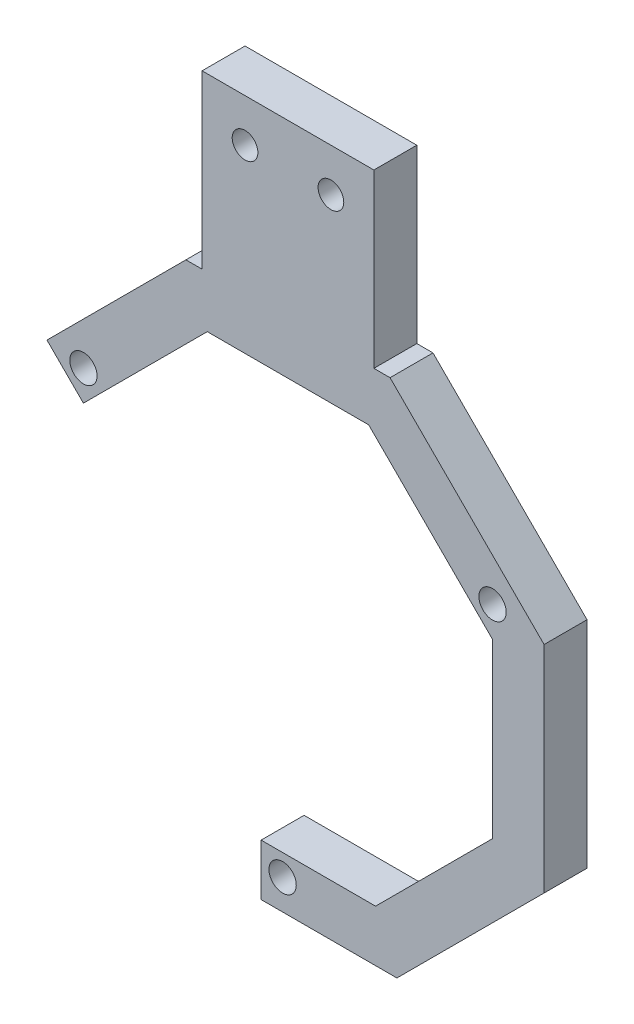
ISO-10303-21;
HEADER;
FILE_DESCRIPTION(('STEP AP214'),'2;1');
FILE_NAME('part.step','',(''),(''),'','','');
FILE_SCHEMA(('AUTOMOTIVE_DESIGN { 1 0 10303 214 1 1 1 1 }'));
ENDSEC;
DATA;
#1=APPLICATION_CONTEXT('core data for automotive mechanical design processes');
#2=APPLICATION_PROTOCOL_DEFINITION('international standard','automotive_design',2000,#1);
#3=PRODUCT_CONTEXT('',#1,'mechanical');
#4=PRODUCT('Part','Part','',(#3));
#5=PRODUCT_RELATED_PRODUCT_CATEGORY('part','',(#4));
#6=PRODUCT_DEFINITION_FORMATION('','',#4);
#7=PRODUCT_DEFINITION_CONTEXT('part definition',#1,'design');
#8=PRODUCT_DEFINITION('design','',#6,#7);
#9=PRODUCT_DEFINITION_SHAPE('','',#8);
#10=(LENGTH_UNIT() NAMED_UNIT(*) SI_UNIT(.MILLI.,.METRE.));
#11=(NAMED_UNIT(*) PLANE_ANGLE_UNIT() SI_UNIT($,.RADIAN.));
#12=(NAMED_UNIT(*) SI_UNIT($,.STERADIAN.) SOLID_ANGLE_UNIT());
#13=UNCERTAINTY_MEASURE_WITH_UNIT(LENGTH_MEASURE(1.E-05),#10,'distance_accuracy_value','');
#14=(GEOMETRIC_REPRESENTATION_CONTEXT(3) GLOBAL_UNCERTAINTY_ASSIGNED_CONTEXT((#13)) GLOBAL_UNIT_ASSIGNED_CONTEXT((#10,
#11,#12)) REPRESENTATION_CONTEXT('',''));
#15=CARTESIAN_POINT('',(0.,0.,0.));
#16=DIRECTION('',(0.,0.,1.));
#17=DIRECTION('',(1.,0.,0.));
#18=AXIS2_PLACEMENT_3D('',#15,#16,#17);
#19=CARTESIAN_POINT('',(-35.6340908998129,17.2379935969734,6.35));
#20=DIRECTION('',(0.707106781186547,0.707106781186548,0.));
#21=DIRECTION('',(-0.707106781186548,0.707106781186547,0.));
#22=AXIS2_PLACEMENT_3D('',#19,#20,#21);
#23=PLANE('',#22);
#24=DIRECTION('',(0.707106781186548,-0.707106781186547,0.));
#25=VECTOR('',#24,1.);
#26=CARTESIAN_POINT('',(-35.6340908998129,17.2379935969734,0.));
#27=LINE('',#26,#25);
#28=CARTESIAN_POINT('',(-35.6340908998129,17.2379935969734,0.));
#29=VERTEX_POINT('',#28);
#30=CARTESIAN_POINT('',(-30.2459372271714,11.8498399243319,0.));
#31=VERTEX_POINT('',#30);
#32=EDGE_CURVE('E188',#29,#31,#27,.T.);
#33=ORIENTED_EDGE('',*,*,#32,.T.);
#34=DIRECTION('',(0.,0.,-1.));
#35=VECTOR('',#34,1.);
#36=CARTESIAN_POINT('',(-30.2459372271714,11.8498399243319,6.35));
#37=LINE('',#36,#35);
#38=CARTESIAN_POINT('',(-30.2459372271714,11.8498399243319,6.35));
#39=VERTEX_POINT('',#38);
#40=EDGE_CURVE('E11',#39,#31,#37,.T.);
#41=ORIENTED_EDGE('',*,*,#40,.F.);
#42=DIRECTION('',(0.707106781186548,-0.707106781186547,0.));
#43=VECTOR('',#42,1.);
#44=CARTESIAN_POINT('',(-35.6340908998129,17.2379935969734,6.35));
#45=LINE('',#44,#43);
#46=CARTESIAN_POINT('',(-35.6340908998129,17.2379935969734,6.35));
#47=VERTEX_POINT('',#46);
#48=EDGE_CURVE('E223',#47,#39,#45,.T.);
#49=ORIENTED_EDGE('',*,*,#48,.F.);
#50=DIRECTION('',(0.,0.,-1.));
#51=VECTOR('',#50,1.);
#52=CARTESIAN_POINT('',(-35.6340908998129,17.2379935969734,6.35));
#53=LINE('',#52,#51);
#54=EDGE_CURVE('E184',#47,#29,#53,.T.);
#55=ORIENTED_EDGE('',*,*,#54,.T.);
#56=EDGE_LOOP('',(#33,#41,#49,#55));
#57=FACE_BOUND('',#56,.T.);
#58=ADVANCED_FACE('F32',(#57),#23,.F.);
#59=CARTESIAN_POINT('',(-30.2459372271714,11.8498399243319,6.35));
#60=DIRECTION('',(-0.707106781186548,0.707106781186547,0.));
#61=DIRECTION('',(-0.707106781186547,-0.707106781186548,0.));
#62=AXIS2_PLACEMENT_3D('',#59,#60,#61);
#63=PLANE('',#62);
#64=DIRECTION('',(0.707106781186547,0.707106781186548,0.));
#65=VECTOR('',#64,1.);
#66=CARTESIAN_POINT('',(-30.2459372271714,11.8498399243319,0.));
#67=LINE('',#66,#65);
#68=CARTESIAN_POINT('',(-11.9332771515032,30.1625000000002,0.));
#69=VERTEX_POINT('',#68);
#70=EDGE_CURVE('E191',#31,#69,#67,.T.);
#71=ORIENTED_EDGE('',*,*,#70,.T.);
#72=DIRECTION('',(0.,0.,-1.));
#73=VECTOR('',#72,1.);
#74=CARTESIAN_POINT('',(-11.9332771515032,30.1625000000002,6.35));
#75=LINE('',#74,#73);
#76=CARTESIAN_POINT('',(-11.9332771515032,30.1625000000002,6.35));
#77=VERTEX_POINT('',#76);
#78=EDGE_CURVE('E40',#77,#69,#75,.T.);
#79=ORIENTED_EDGE('',*,*,#78,.F.);
#80=DIRECTION('',(0.707106781186547,0.707106781186548,0.));
#81=VECTOR('',#80,1.);
#82=CARTESIAN_POINT('',(-30.2459372271714,11.8498399243319,6.35));
#83=LINE('',#82,#81);
#84=EDGE_CURVE('E121',#39,#77,#83,.T.);
#85=ORIENTED_EDGE('',*,*,#84,.F.);
#86=ORIENTED_EDGE('',*,*,#40,.T.);
#87=EDGE_LOOP('',(#71,#79,#85,#86));
#88=FACE_BOUND('',#87,.T.);
#89=ADVANCED_FACE('F332',(#88),#63,.F.);
#90=CARTESIAN_POINT('',(-11.9332771515032,30.1625000000002,6.35));
#91=DIRECTION('',(0.,1.,0.));
#92=DIRECTION('',(0.,0.,1.));
#93=AXIS2_PLACEMENT_3D('',#90,#91,#92);
#94=PLANE('',#93);
#95=DIRECTION('',(1.,0.,0.));
#96=VECTOR('',#95,1.);
#97=CARTESIAN_POINT('',(-11.9332771515032,30.1625000000002,0.));
#98=LINE('',#97,#96);
#99=CARTESIAN_POINT('',(11.9332771515033,30.1625000000002,0.));
#100=VERTEX_POINT('',#99);
#101=EDGE_CURVE('E194',#69,#100,#98,.T.);
#102=ORIENTED_EDGE('',*,*,#101,.T.);
#103=DIRECTION('',(0.,0.,-1.));
#104=VECTOR('',#103,1.);
#105=CARTESIAN_POINT('',(11.9332771515033,30.1625000000002,6.35));
#106=LINE('',#105,#104);
#107=CARTESIAN_POINT('',(11.9332771515033,30.1625000000002,6.35));
#108=VERTEX_POINT('',#107);
#109=EDGE_CURVE('E260',#108,#100,#106,.T.);
#110=ORIENTED_EDGE('',*,*,#109,.F.);
#111=DIRECTION('',(1.,0.,0.));
#112=VECTOR('',#111,1.);
#113=CARTESIAN_POINT('',(-11.9332771515032,30.1625000000002,6.35));
#114=LINE('',#113,#112);
#115=EDGE_CURVE('E268',#77,#108,#114,.T.);
#116=ORIENTED_EDGE('',*,*,#115,.F.);
#117=ORIENTED_EDGE('',*,*,#78,.T.);
#118=EDGE_LOOP('',(#102,#110,#116,#117));
#119=FACE_BOUND('',#118,.T.);
#120=ADVANCED_FACE('F266',(#119),#94,.F.);
#121=CARTESIAN_POINT('',(11.9332771515033,30.1625000000002,6.35));
#122=DIRECTION('',(0.70710678118655,0.707106781186545,0.));
#123=DIRECTION('',(-0.707106781186545,0.70710678118655,0.));
#124=AXIS2_PLACEMENT_3D('',#121,#122,#123);
#125=PLANE('',#124);
#126=DIRECTION('',(0.707106781186545,-0.70710678118655,0.));
#127=VECTOR('',#126,1.);
#128=CARTESIAN_POINT('',(11.9332771515033,30.1625000000002,0.));
#129=LINE('',#128,#127);
#130=CARTESIAN_POINT('',(30.2459372271714,11.8498399243319,0.));
#131=VERTEX_POINT('',#130);
#132=EDGE_CURVE('E196',#100,#131,#129,.T.);
#133=ORIENTED_EDGE('',*,*,#132,.T.);
#134=DIRECTION('',(0.,0.,-1.));
#135=VECTOR('',#134,1.);
#136=CARTESIAN_POINT('',(30.2459372271714,11.8498399243319,6.35));
#137=LINE('',#136,#135);
#138=CARTESIAN_POINT('',(30.2459372271714,11.8498399243319,6.35));
#139=VERTEX_POINT('',#138);
#140=EDGE_CURVE('E257',#139,#131,#137,.T.);
#141=ORIENTED_EDGE('',*,*,#140,.F.);
#142=DIRECTION('',(0.707106781186545,-0.70710678118655,0.));
#143=VECTOR('',#142,1.);
#144=CARTESIAN_POINT('',(11.9332771515033,30.1625000000002,6.35));
#145=LINE('',#144,#143);
#146=EDGE_CURVE('E286',#108,#139,#145,.T.);
#147=ORIENTED_EDGE('',*,*,#146,.F.);
#148=ORIENTED_EDGE('',*,*,#109,.T.);
#149=EDGE_LOOP('',(#133,#141,#147,#148));
#150=FACE_BOUND('',#149,.T.);
#151=ADVANCED_FACE('F277',(#150),#125,.F.);
#152=CARTESIAN_POINT('',(30.2459372271714,11.8498399243319,6.35));
#153=DIRECTION('',(1.,0.,0.));
#154=DIRECTION('',(0.,0.,-1.));
#155=AXIS2_PLACEMENT_3D('',#152,#153,#154);
#156=PLANE('',#155);
#157=DIRECTION('',(0.,-1.,0.));
#158=VECTOR('',#157,1.);
#159=CARTESIAN_POINT('',(30.2459372271714,11.8498399243319,0.));
#160=LINE('',#159,#158);
#161=CARTESIAN_POINT('',(30.2459372271714,-13.6593188938978,0.));
#162=VERTEX_POINT('',#161);
#163=EDGE_CURVE('E198',#131,#162,#160,.T.);
#164=ORIENTED_EDGE('',*,*,#163,.T.);
#165=DIRECTION('',(0.,0.,-1.));
#166=VECTOR('',#165,1.);
#167=CARTESIAN_POINT('',(30.2459372271714,-13.6593188938978,6.35));
#168=LINE('',#167,#166);
#169=CARTESIAN_POINT('',(30.2459372271714,-13.6593188938978,6.35));
#170=VERTEX_POINT('',#169);
#171=EDGE_CURVE('E254',#170,#162,#168,.T.);
#172=ORIENTED_EDGE('',*,*,#171,.F.);
#173=DIRECTION('',(0.,-1.,0.));
#174=VECTOR('',#173,1.);
#175=CARTESIAN_POINT('',(30.2459372271714,11.8498399243319,6.35));
#176=LINE('',#175,#174);
#177=EDGE_CURVE('E283',#139,#170,#176,.T.);
#178=ORIENTED_EDGE('',*,*,#177,.F.);
#179=ORIENTED_EDGE('',*,*,#140,.T.);
#180=EDGE_LOOP('',(#164,#172,#178,#179));
#181=FACE_BOUND('',#180,.T.);
#182=ADVANCED_FACE('F281',(#181),#156,.F.);
#183=CARTESIAN_POINT('',(30.2459372271714,-13.6593188938978,6.35));
#184=DIRECTION('',(0.707106781186546,-0.707106781186549,0.));
#185=DIRECTION('',(0.707106781186549,0.707106781186546,0.));
#186=AXIS2_PLACEMENT_3D('',#183,#184,#185);
#187=PLANE('',#186);
#188=DIRECTION('',(-0.707106781186549,-0.707106781186546,0.));
#189=VECTOR('',#188,1.);
#190=CARTESIAN_POINT('',(30.2459372271714,-13.6593188938978,0.));
#191=LINE('',#190,#189);
#192=CARTESIAN_POINT('',(12.9490061210692,-30.95625,0.));
#193=VERTEX_POINT('',#192);
#194=EDGE_CURVE('E200',#162,#193,#191,.T.);
#195=ORIENTED_EDGE('',*,*,#194,.T.);
#196=DIRECTION('',(0.,0.,-1.));
#197=VECTOR('',#196,1.);
#198=CARTESIAN_POINT('',(12.9490061210692,-30.95625,6.35));
#199=LINE('',#198,#197);
#200=CARTESIAN_POINT('',(12.9490061210692,-30.95625,6.35));
#201=VERTEX_POINT('',#200);
#202=EDGE_CURVE('E251',#201,#193,#199,.T.);
#203=ORIENTED_EDGE('',*,*,#202,.F.);
#204=DIRECTION('',(-0.707106781186549,-0.707106781186546,0.));
#205=VECTOR('',#204,1.);
#206=CARTESIAN_POINT('',(30.2459372271714,-13.6593188938978,6.35));
#207=LINE('',#206,#205);
#208=EDGE_CURVE('E285',#170,#201,#207,.T.);
#209=ORIENTED_EDGE('',*,*,#208,.F.);
#210=ORIENTED_EDGE('',*,*,#171,.T.);
#211=EDGE_LOOP('',(#195,#203,#209,#210));
#212=FACE_BOUND('',#211,.T.);
#213=ADVANCED_FACE('F345',(#212),#187,.F.);
#214=CARTESIAN_POINT('',(12.9490061210692,-30.95625,6.35));
#215=DIRECTION('',(0.,-1.,0.));
#216=DIRECTION('',(1.,0.,0.));
#217=AXIS2_PLACEMENT_3D('',#214,#215,#216);
#218=PLANE('',#217);
#219=DIRECTION('',(-1.,0.,0.));
#220=VECTOR('',#219,1.);
#221=CARTESIAN_POINT('',(12.9490061210692,-30.95625,0.));
#222=LINE('',#221,#220);
#223=CARTESIAN_POINT('',(-3.96875,-30.95625,0.));
#224=VERTEX_POINT('',#223);
#225=EDGE_CURVE('E202',#193,#224,#222,.T.);
#226=ORIENTED_EDGE('',*,*,#225,.T.);
#227=DIRECTION('',(0.,0.,-1.));
#228=VECTOR('',#227,1.);
#229=CARTESIAN_POINT('',(-3.96875,-30.95625,6.35));
#230=LINE('',#229,#228);
#231=CARTESIAN_POINT('',(-3.96875,-30.95625,6.35));
#232=VERTEX_POINT('',#231);
#233=EDGE_CURVE('E248',#232,#224,#230,.T.);
#234=ORIENTED_EDGE('',*,*,#233,.F.);
#235=DIRECTION('',(-1.,0.,0.));
#236=VECTOR('',#235,1.);
#237=CARTESIAN_POINT('',(12.9490061210692,-30.95625,6.35));
#238=LINE('',#237,#236);
#239=EDGE_CURVE('E288',#201,#232,#238,.T.);
#240=ORIENTED_EDGE('',*,*,#239,.F.);
#241=ORIENTED_EDGE('',*,*,#202,.T.);
#242=EDGE_LOOP('',(#226,#234,#240,#241));
#243=FACE_BOUND('',#242,.T.);
#244=ADVANCED_FACE('F348',(#243),#218,.F.);
#245=CARTESIAN_POINT('',(-3.96875,-30.95625,6.35));
#246=DIRECTION('',(1.,0.,0.));
#247=DIRECTION('',(0.,1.,0.));
#248=AXIS2_PLACEMENT_3D('',#245,#246,#247);
#249=PLANE('',#248);
#250=DIRECTION('',(0.,-1.,0.));
#251=VECTOR('',#250,1.);
#252=CARTESIAN_POINT('',(-3.96875,-30.95625,0.));
#253=LINE('',#252,#251);
#254=CARTESIAN_POINT('',(-3.96875,-38.57625,0.));
#255=VERTEX_POINT('',#254);
#256=EDGE_CURVE('E204',#224,#255,#253,.T.);
#257=ORIENTED_EDGE('',*,*,#256,.T.);
#258=DIRECTION('',(0.,0.,-1.));
#259=VECTOR('',#258,1.);
#260=CARTESIAN_POINT('',(-3.96875,-38.57625,6.35));
#261=LINE('',#260,#259);
#262=CARTESIAN_POINT('',(-3.96875,-38.57625,6.35));
#263=VERTEX_POINT('',#262);
#264=EDGE_CURVE('E245',#263,#255,#261,.T.);
#265=ORIENTED_EDGE('',*,*,#264,.F.);
#266=DIRECTION('',(0.,-1.,0.));
#267=VECTOR('',#266,1.);
#268=CARTESIAN_POINT('',(-3.96875,-30.95625,6.35));
#269=LINE('',#268,#267);
#270=EDGE_CURVE('E294',#232,#263,#269,.T.);
#271=ORIENTED_EDGE('',*,*,#270,.F.);
#272=ORIENTED_EDGE('',*,*,#233,.T.);
#273=EDGE_LOOP('',(#257,#265,#271,#272));
#274=FACE_BOUND('',#273,.T.);
#275=ADVANCED_FACE('F352',(#274),#249,.F.);
#276=CARTESIAN_POINT('',(-3.96875,-38.57625,6.35));
#277=DIRECTION('',(0.,1.,0.));
#278=DIRECTION('',(0.,0.,1.));
#279=AXIS2_PLACEMENT_3D('',#276,#277,#278);
#280=PLANE('',#279);
#281=DIRECTION('',(1.,0.,0.));
#282=VECTOR('',#281,1.);
#283=CARTESIAN_POINT('',(-3.96875,-38.57625,0.));
#284=LINE('',#283,#282);
#285=CARTESIAN_POINT('',(16.1053134663522,-38.57625,0.));
#286=VERTEX_POINT('',#285);
#287=EDGE_CURVE('E206',#255,#286,#284,.T.);
#288=ORIENTED_EDGE('',*,*,#287,.T.);
#289=DIRECTION('',(0.,0.,-1.));
#290=VECTOR('',#289,1.);
#291=CARTESIAN_POINT('',(16.1053134663522,-38.57625,6.35));
#292=LINE('',#291,#290);
#293=CARTESIAN_POINT('',(16.1053134663522,-38.57625,6.35));
#294=VERTEX_POINT('',#293);
#295=EDGE_CURVE('E242',#294,#286,#292,.T.);
#296=ORIENTED_EDGE('',*,*,#295,.F.);
#297=DIRECTION('',(1.,0.,0.));
#298=VECTOR('',#297,1.);
#299=CARTESIAN_POINT('',(-3.96875,-38.57625,6.35));
#300=LINE('',#299,#298);
#301=EDGE_CURVE('E296',#263,#294,#300,.T.);
#302=ORIENTED_EDGE('',*,*,#301,.F.);
#303=ORIENTED_EDGE('',*,*,#264,.T.);
#304=EDGE_LOOP('',(#288,#296,#302,#303));
#305=FACE_BOUND('',#304,.T.);
#306=ADVANCED_FACE('F356',(#305),#280,.F.);
#307=CARTESIAN_POINT('',(37.8659372271714,-16.8156262391808,6.35));
#308=DIRECTION('',(-0.707106781186546,0.707106781186549,0.));
#309=DIRECTION('',(-0.707106781186549,-0.707106781186546,0.));
#310=AXIS2_PLACEMENT_3D('',#307,#308,#309);
#311=PLANE('',#310);
#312=DIRECTION('',(0.707106781186549,0.707106781186546,0.));
#313=VECTOR('',#312,1.);
#314=CARTESIAN_POINT('',(37.8659372271714,-16.8156262391808,0.));
#315=LINE('',#314,#313);
#316=CARTESIAN_POINT('',(37.8659372271714,-16.8156262391808,0.));
#317=VERTEX_POINT('',#316);
#318=EDGE_CURVE('E208',#286,#317,#315,.T.);
#319=ORIENTED_EDGE('',*,*,#318,.T.);
#320=DIRECTION('',(0.,0.,-1.));
#321=VECTOR('',#320,1.);
#322=CARTESIAN_POINT('',(37.8659372271714,-16.8156262391808,6.35));
#323=LINE('',#322,#321);
#324=CARTESIAN_POINT('',(37.8659372271714,-16.8156262391808,6.35));
#325=VERTEX_POINT('',#324);
#326=EDGE_CURVE('E239',#325,#317,#323,.T.);
#327=ORIENTED_EDGE('',*,*,#326,.F.);
#328=DIRECTION('',(0.707106781186549,0.707106781186546,0.));
#329=VECTOR('',#328,1.);
#330=CARTESIAN_POINT('',(37.8659372271714,-16.8156262391808,6.35));
#331=LINE('',#330,#329);
#332=EDGE_CURVE('E298',#294,#325,#331,.T.);
#333=ORIENTED_EDGE('',*,*,#332,.F.);
#334=ORIENTED_EDGE('',*,*,#295,.T.);
#335=EDGE_LOOP('',(#319,#327,#333,#334));
#336=FACE_BOUND('',#335,.T.);
#337=ADVANCED_FACE('F360',(#336),#311,.F.);
#338=CARTESIAN_POINT('',(37.8659372271714,15.0061472696149,6.35));
#339=DIRECTION('',(-1.,0.,0.));
#340=DIRECTION('',(0.,-1.,0.));
#341=AXIS2_PLACEMENT_3D('',#338,#339,#340);
#342=PLANE('',#341);
#343=DIRECTION('',(0.,1.,0.));
#344=VECTOR('',#343,1.);
#345=CARTESIAN_POINT('',(37.8659372271714,15.0061472696149,0.));
#346=LINE('',#345,#344);
#347=CARTESIAN_POINT('',(37.8659372271714,15.0061472696149,0.));
#348=VERTEX_POINT('',#347);
#349=EDGE_CURVE('E210',#317,#348,#346,.T.);
#350=ORIENTED_EDGE('',*,*,#349,.T.);
#351=DIRECTION('',(0.,0.,-1.));
#352=VECTOR('',#351,1.);
#353=CARTESIAN_POINT('',(37.8659372271714,15.0061472696149,6.35));
#354=LINE('',#353,#352);
#355=CARTESIAN_POINT('',(37.8659372271714,15.0061472696149,6.35));
#356=VERTEX_POINT('',#355);
#357=EDGE_CURVE('E236',#356,#348,#354,.T.);
#358=ORIENTED_EDGE('',*,*,#357,.F.);
#359=DIRECTION('',(0.,1.,0.));
#360=VECTOR('',#359,1.);
#361=CARTESIAN_POINT('',(37.8659372271714,15.0061472696149,6.35));
#362=LINE('',#361,#360);
#363=EDGE_CURVE('E300',#325,#356,#362,.T.);
#364=ORIENTED_EDGE('',*,*,#363,.F.);
#365=ORIENTED_EDGE('',*,*,#326,.T.);
#366=EDGE_LOOP('',(#350,#358,#364,#365));
#367=FACE_BOUND('',#366,.T.);
#368=ADVANCED_FACE('F364',(#367),#342,.F.);
#369=CARTESIAN_POINT('',(15.0895844967863,37.7825000000002,6.35));
#370=DIRECTION('',(-0.70710678118655,-0.707106781186545,0.));
#371=DIRECTION('',(0.707106781186545,-0.70710678118655,0.));
#372=AXIS2_PLACEMENT_3D('',#369,#370,#371);
#373=PLANE('',#372);
#374=DIRECTION('',(-0.707106781186545,0.70710678118655,0.));
#375=VECTOR('',#374,1.);
#376=CARTESIAN_POINT('',(15.0895844967863,37.7825000000002,0.));
#377=LINE('',#376,#375);
#378=CARTESIAN_POINT('',(15.0895844967863,37.7825000000002,0.));
#379=VERTEX_POINT('',#378);
#380=EDGE_CURVE('E212',#348,#379,#377,.T.);
#381=ORIENTED_EDGE('',*,*,#380,.T.);
#382=DIRECTION('',(0.,0.,-1.));
#383=VECTOR('',#382,1.);
#384=CARTESIAN_POINT('',(15.0895844967863,37.7825000000002,6.35));
#385=LINE('',#384,#383);
#386=CARTESIAN_POINT('',(15.0895844967863,37.7825000000002,6.35));
#387=VERTEX_POINT('',#386);
#388=EDGE_CURVE('E233',#387,#379,#385,.T.);
#389=ORIENTED_EDGE('',*,*,#388,.F.);
#390=DIRECTION('',(-0.707106781186545,0.70710678118655,0.));
#391=VECTOR('',#390,1.);
#392=CARTESIAN_POINT('',(15.0895844967863,37.7825000000002,6.35));
#393=LINE('',#392,#391);
#394=EDGE_CURVE('E302',#356,#387,#393,.T.);
#395=ORIENTED_EDGE('',*,*,#394,.F.);
#396=ORIENTED_EDGE('',*,*,#357,.T.);
#397=EDGE_LOOP('',(#381,#389,#395,#396));
#398=FACE_BOUND('',#397,.T.);
#399=ADVANCED_FACE('F368',(#398),#373,.F.);
#400=CARTESIAN_POINT('',(12.7,37.7825000000002,6.35));
#401=DIRECTION('',(0.,-1.,0.));
#402=DIRECTION('',(0.,0.,-1.));
#403=AXIS2_PLACEMENT_3D('',#400,#401,#402);
#404=PLANE('',#403);
#405=DIRECTION('',(-1.,0.,0.));
#406=VECTOR('',#405,1.);
#407=CARTESIAN_POINT('',(12.7,37.7825000000002,0.));
#408=LINE('',#407,#406);
#409=CARTESIAN_POINT('',(12.7,37.7825000000002,0.));
#410=VERTEX_POINT('',#409);
#411=EDGE_CURVE('E214',#379,#410,#408,.T.);
#412=ORIENTED_EDGE('',*,*,#411,.T.);
#413=DIRECTION('',(0.,0.,-1.));
#414=VECTOR('',#413,1.);
#415=CARTESIAN_POINT('',(12.7,37.7825000000002,6.35));
#416=LINE('',#415,#414);
#417=CARTESIAN_POINT('',(12.7,37.7825000000002,6.35));
#418=VERTEX_POINT('',#417);
#419=EDGE_CURVE('E230',#418,#410,#416,.T.);
#420=ORIENTED_EDGE('',*,*,#419,.F.);
#421=DIRECTION('',(-1.,0.,0.));
#422=VECTOR('',#421,1.);
#423=CARTESIAN_POINT('',(12.7,37.7825000000002,6.35));
#424=LINE('',#423,#422);
#425=EDGE_CURVE('E304',#387,#418,#424,.T.);
#426=ORIENTED_EDGE('',*,*,#425,.F.);
#427=ORIENTED_EDGE('',*,*,#388,.T.);
#428=EDGE_LOOP('',(#412,#420,#426,#427));
#429=FACE_BOUND('',#428,.T.);
#430=ADVANCED_FACE('F372',(#429),#404,.F.);
#431=CARTESIAN_POINT('',(12.7,37.7825000000002,6.35));
#432=DIRECTION('',(-1.,0.,0.));
#433=DIRECTION('',(0.,-1.,0.));
#434=AXIS2_PLACEMENT_3D('',#431,#432,#433);
#435=PLANE('',#434);
#436=DIRECTION('',(0.,1.,0.));
#437=VECTOR('',#436,1.);
#438=CARTESIAN_POINT('',(12.7,37.7825000000002,0.));
#439=LINE('',#438,#437);
#440=CARTESIAN_POINT('',(12.7,63.1825000000002,0.));
#441=VERTEX_POINT('',#440);
#442=EDGE_CURVE('E216',#410,#441,#439,.T.);
#443=ORIENTED_EDGE('',*,*,#442,.T.);
#444=DIRECTION('',(0.,0.,-1.));
#445=VECTOR('',#444,1.);
#446=CARTESIAN_POINT('',(12.7,63.1825000000002,6.35));
#447=LINE('',#446,#445);
#448=CARTESIAN_POINT('',(12.7,63.1825000000002,6.35));
#449=VERTEX_POINT('',#448);
#450=EDGE_CURVE('E227',#449,#441,#447,.T.);
#451=ORIENTED_EDGE('',*,*,#450,.F.);
#452=DIRECTION('',(0.,1.,0.));
#453=VECTOR('',#452,1.);
#454=CARTESIAN_POINT('',(12.7,37.7825000000002,6.35));
#455=LINE('',#454,#453);
#456=EDGE_CURVE('E306',#418,#449,#455,.T.);
#457=ORIENTED_EDGE('',*,*,#456,.F.);
#458=ORIENTED_EDGE('',*,*,#419,.T.);
#459=EDGE_LOOP('',(#443,#451,#457,#458));
#460=FACE_BOUND('',#459,.T.);
#461=ADVANCED_FACE('F312',(#460),#435,.F.);
#462=CARTESIAN_POINT('',(-12.7,63.1825000000002,6.35));
#463=DIRECTION('',(0.,-1.,0.));
#464=DIRECTION('',(0.,0.,-1.));
#465=AXIS2_PLACEMENT_3D('',#462,#463,#464);
#466=PLANE('',#465);
#467=DIRECTION('',(-1.,0.,0.));
#468=VECTOR('',#467,1.);
#469=CARTESIAN_POINT('',(-12.7,63.1825000000002,0.));
#470=LINE('',#469,#468);
#471=CARTESIAN_POINT('',(-12.7,63.1825000000002,0.));
#472=VERTEX_POINT('',#471);
#473=EDGE_CURVE('E218',#441,#472,#470,.T.);
#474=ORIENTED_EDGE('',*,*,#473,.T.);
#475=DIRECTION('',(0.,0.,-1.));
#476=VECTOR('',#475,1.);
#477=CARTESIAN_POINT('',(-12.7,63.1825000000002,6.35));
#478=LINE('',#477,#476);
#479=CARTESIAN_POINT('',(-12.7,63.1825000000002,6.35));
#480=VERTEX_POINT('',#479);
#481=EDGE_CURVE('E179',#480,#472,#478,.T.);
#482=ORIENTED_EDGE('',*,*,#481,.F.);
#483=DIRECTION('',(-1.,0.,0.));
#484=VECTOR('',#483,1.);
#485=CARTESIAN_POINT('',(-12.7,63.1825000000002,6.35));
#486=LINE('',#485,#484);
#487=EDGE_CURVE('E170',#449,#480,#486,.T.);
#488=ORIENTED_EDGE('',*,*,#487,.F.);
#489=ORIENTED_EDGE('',*,*,#450,.T.);
#490=EDGE_LOOP('',(#474,#482,#488,#489));
#491=FACE_BOUND('',#490,.T.);
#492=ADVANCED_FACE('F316',(#491),#466,.F.);
#493=CARTESIAN_POINT('',(-12.7,37.7825000000002,6.35));
#494=DIRECTION('',(1.,0.,0.));
#495=DIRECTION('',(0.,1.,0.));
#496=AXIS2_PLACEMENT_3D('',#493,#494,#495);
#497=PLANE('',#496);
#498=DIRECTION('',(0.,-1.,0.));
#499=VECTOR('',#498,1.);
#500=CARTESIAN_POINT('',(-12.7,37.7825000000002,0.));
#501=LINE('',#500,#499);
#502=CARTESIAN_POINT('',(-12.7,37.7825000000002,0.));
#503=VERTEX_POINT('',#502);
#504=EDGE_CURVE('E178',#472,#503,#501,.T.);
#505=ORIENTED_EDGE('',*,*,#504,.T.);
#506=DIRECTION('',(0.,0.,-1.));
#507=VECTOR('',#506,1.);
#508=CARTESIAN_POINT('',(-12.7,37.7825000000002,6.35));
#509=LINE('',#508,#507);
#510=CARTESIAN_POINT('',(-12.7,37.7825000000002,6.35));
#511=VERTEX_POINT('',#510);
#512=EDGE_CURVE('E175',#511,#503,#509,.T.);
#513=ORIENTED_EDGE('',*,*,#512,.F.);
#514=DIRECTION('',(0.,-1.,0.));
#515=VECTOR('',#514,1.);
#516=CARTESIAN_POINT('',(-12.7,37.7825000000002,6.35));
#517=LINE('',#516,#515);
#518=EDGE_CURVE('E164',#480,#511,#517,.T.);
#519=ORIENTED_EDGE('',*,*,#518,.F.);
#520=ORIENTED_EDGE('',*,*,#481,.T.);
#521=EDGE_LOOP('',(#505,#513,#519,#520));
#522=FACE_BOUND('',#521,.T.);
#523=ADVANCED_FACE('F176',(#522),#497,.F.);
#524=CARTESIAN_POINT('',(-15.0895844967862,37.7825000000002,6.35));
#525=DIRECTION('',(0.,-1.,0.));
#526=DIRECTION('',(0.,0.,-1.));
#527=AXIS2_PLACEMENT_3D('',#524,#525,#526);
#528=PLANE('',#527);
#529=DIRECTION('',(-1.,0.,0.));
#530=VECTOR('',#529,1.);
#531=CARTESIAN_POINT('',(-15.0895844967862,37.7825000000002,0.));
#532=LINE('',#531,#530);
#533=CARTESIAN_POINT('',(-15.0895844967862,37.7825000000002,0.));
#534=VERTEX_POINT('',#533);
#535=EDGE_CURVE('E107',#503,#534,#532,.T.);
#536=ORIENTED_EDGE('',*,*,#535,.T.);
#537=DIRECTION('',(0.,0.,-1.));
#538=VECTOR('',#537,1.);
#539=CARTESIAN_POINT('',(-15.0895844967862,37.7825000000002,6.35));
#540=LINE('',#539,#538);
#541=CARTESIAN_POINT('',(-15.0895844967862,37.7825000000002,6.35));
#542=VERTEX_POINT('',#541);
#543=EDGE_CURVE('E180',#542,#534,#540,.T.);
#544=ORIENTED_EDGE('',*,*,#543,.F.);
#545=DIRECTION('',(-1.,0.,0.));
#546=VECTOR('',#545,1.);
#547=CARTESIAN_POINT('',(-15.0895844967862,37.7825000000002,6.35));
#548=LINE('',#547,#546);
#549=EDGE_CURVE('E168',#511,#542,#548,.T.);
#550=ORIENTED_EDGE('',*,*,#549,.F.);
#551=ORIENTED_EDGE('',*,*,#512,.T.);
#552=EDGE_LOOP('',(#536,#544,#550,#551));
#553=FACE_BOUND('',#552,.T.);
#554=ADVANCED_FACE('F182',(#553),#528,.F.);
#555=CARTESIAN_POINT('',(-35.6340908998129,17.2379935969734,6.35));
#556=DIRECTION('',(0.707106781186548,-0.707106781186547,0.));
#557=DIRECTION('',(0.707106781186547,0.707106781186548,0.));
#558=AXIS2_PLACEMENT_3D('',#555,#556,#557);
#559=PLANE('',#558);
#560=DIRECTION('',(-0.707106781186547,-0.707106781186548,0.));
#561=VECTOR('',#560,1.);
#562=CARTESIAN_POINT('',(-35.6340908998129,17.2379935969734,0.));
#563=LINE('',#562,#561);
#564=EDGE_CURVE('E113',#534,#29,#563,.T.);
#565=ORIENTED_EDGE('',*,*,#564,.T.);
#566=ORIENTED_EDGE('',*,*,#54,.F.);
#567=DIRECTION('',(-0.707106781186547,-0.707106781186548,0.));
#568=VECTOR('',#567,1.);
#569=CARTESIAN_POINT('',(-35.6340908998129,17.2379935969734,6.35));
#570=LINE('',#569,#568);
#571=EDGE_CURVE('E48',#542,#47,#570,.T.);
#572=ORIENTED_EDGE('',*,*,#571,.F.);
#573=ORIENTED_EDGE('',*,*,#543,.T.);
#574=EDGE_LOOP('',(#565,#566,#572,#573));
#575=FACE_BOUND('',#574,.T.);
#576=ADVANCED_FACE('F320',(#575),#559,.F.);
#577=CARTESIAN_POINT('',(0.,0.,6.35));
#578=DIRECTION('',(0.,0.,1.));
#579=DIRECTION('',(1.,0.,0.));
#580=AXIS2_PLACEMENT_3D('',#577,#578,#579);
#581=PLANE('',#580);
#582=CARTESIAN_POINT('',(-6.34999999999996,56.8325000000002,6.35));
#583=DIRECTION('',(0.,0.,1.));
#584=DIRECTION('',(1.,0.,0.));
#585=AXIS2_PLACEMENT_3D('',#582,#583,#584);
#586=CIRCLE('',#585,1.89864999999999);
#587=CARTESIAN_POINT('',(-4.45134999999998,56.8325000000002,6.35));
#588=VERTEX_POINT('',#587);
#589=EDGE_CURVE('E468',#588,#588,#586,.T.);
#590=ORIENTED_EDGE('',*,*,#589,.F.);
#591=EDGE_LOOP('',(#590));
#592=FACE_BOUND('',#591,.T.);
#593=CARTESIAN_POINT('',(6.35000000000004,56.8325000000002,6.35));
#594=DIRECTION('',(0.,0.,1.));
#595=DIRECTION('',(1.,0.,0.));
#596=AXIS2_PLACEMENT_3D('',#593,#594,#595);
#597=CIRCLE('',#596,1.89864999999999);
#598=CARTESIAN_POINT('',(8.24865000000002,56.8325000000002,6.35));
#599=VERTEX_POINT('',#598);
#600=EDGE_CURVE('E470',#599,#599,#597,.T.);
#601=ORIENTED_EDGE('',*,*,#600,.F.);
#602=EDGE_LOOP('',(#601));
#603=FACE_BOUND('',#602,.T.);
#604=CARTESIAN_POINT('',(30.2459372271716,16.3399679848665,6.35));
#605=DIRECTION('',(0.,0.,1.));
#606=DIRECTION('',(1.,0.,0.));
#607=AXIS2_PLACEMENT_3D('',#604,#605,#606);
#608=CIRCLE('',#607,2.01929999999999);
#609=CARTESIAN_POINT('',(32.2652372271716,16.3399679848665,6.35));
#610=VERTEX_POINT('',#609);
#611=EDGE_CURVE('E478',#610,#610,#608,.T.);
#612=ORIENTED_EDGE('',*,*,#611,.F.);
#613=EDGE_LOOP('',(#612));
#614=FACE_BOUND('',#613,.T.);
#615=CARTESIAN_POINT('',(-0.793749999999998,-34.13125,6.35));
#616=DIRECTION('',(0.,0.,1.));
#617=DIRECTION('',(1.,0.,0.));
#618=AXIS2_PLACEMENT_3D('',#615,#616,#617);
#619=CIRCLE('',#618,2.01929999999999);
#620=CARTESIAN_POINT('',(1.22554999999999,-34.13125,6.35));
#621=VERTEX_POINT('',#620);
#622=EDGE_CURVE('E484',#621,#621,#619,.T.);
#623=ORIENTED_EDGE('',*,*,#622,.F.);
#624=EDGE_LOOP('',(#623));
#625=FACE_BOUND('',#624,.T.);
#626=CARTESIAN_POINT('',(-30.2459372271714,16.3399679848665,6.35));
#627=DIRECTION('',(0.,0.,1.));
#628=DIRECTION('',(1.,0.,0.));
#629=AXIS2_PLACEMENT_3D('',#626,#627,#628);
#630=CIRCLE('',#629,2.0193);
#631=CARTESIAN_POINT('',(-28.2266372271714,16.3399679848665,6.35));
#632=VERTEX_POINT('',#631);
#633=EDGE_CURVE('E490',#632,#632,#630,.T.);
#634=ORIENTED_EDGE('',*,*,#633,.F.);
#635=EDGE_LOOP('',(#634));
#636=FACE_BOUND('',#635,.T.);
#637=ORIENTED_EDGE('',*,*,#48,.T.);
#638=ORIENTED_EDGE('',*,*,#84,.T.);
#639=ORIENTED_EDGE('',*,*,#115,.T.);
#640=ORIENTED_EDGE('',*,*,#146,.T.);
#641=ORIENTED_EDGE('',*,*,#177,.T.);
#642=ORIENTED_EDGE('',*,*,#208,.T.);
#643=ORIENTED_EDGE('',*,*,#239,.T.);
#644=ORIENTED_EDGE('',*,*,#270,.T.);
#645=ORIENTED_EDGE('',*,*,#301,.T.);
#646=ORIENTED_EDGE('',*,*,#332,.T.);
#647=ORIENTED_EDGE('',*,*,#363,.T.);
#648=ORIENTED_EDGE('',*,*,#394,.T.);
#649=ORIENTED_EDGE('',*,*,#425,.T.);
#650=ORIENTED_EDGE('',*,*,#456,.T.);
#651=ORIENTED_EDGE('',*,*,#487,.T.);
#652=ORIENTED_EDGE('',*,*,#518,.T.);
#653=ORIENTED_EDGE('',*,*,#549,.T.);
#654=ORIENTED_EDGE('',*,*,#571,.T.);
#655=EDGE_LOOP('',(#637,#638,#639,#640,#641,#642,#643,#644,#645,#646,#647,#648,#649,#650,#651,
#652,#653,#654));
#656=FACE_BOUND('',#655,.T.);
#657=ADVANCED_FACE('F166',(#592,#603,#614,#625,#636,#656),#581,.T.);
#658=CARTESIAN_POINT('',(0.,0.,0.));
#659=DIRECTION('',(0.,0.,1.));
#660=DIRECTION('',(1.,0.,0.));
#661=AXIS2_PLACEMENT_3D('',#658,#659,#660);
#662=PLANE('',#661);
#663=CARTESIAN_POINT('',(-6.34999999999996,56.8325000000002,0.));
#664=DIRECTION('',(0.,0.,1.));
#665=DIRECTION('',(1.,0.,0.));
#666=AXIS2_PLACEMENT_3D('',#663,#664,#665);
#667=CIRCLE('',#666,1.89865);
#668=CARTESIAN_POINT('',(-4.45134999999997,56.8325000000002,0.));
#669=VERTEX_POINT('',#668);
#670=EDGE_CURVE('E465',#669,#669,#667,.T.);
#671=ORIENTED_EDGE('',*,*,#670,.T.);
#672=EDGE_LOOP('',(#671));
#673=FACE_BOUND('',#672,.T.);
#674=CARTESIAN_POINT('',(6.35000000000004,56.8325000000002,0.));
#675=DIRECTION('',(0.,0.,1.));
#676=DIRECTION('',(1.,0.,0.));
#677=AXIS2_PLACEMENT_3D('',#674,#675,#676);
#678=CIRCLE('',#677,1.89865);
#679=CARTESIAN_POINT('',(8.24865000000004,56.8325000000002,0.));
#680=VERTEX_POINT('',#679);
#681=EDGE_CURVE('E475',#680,#680,#678,.T.);
#682=ORIENTED_EDGE('',*,*,#681,.T.);
#683=EDGE_LOOP('',(#682));
#684=FACE_BOUND('',#683,.T.);
#685=CARTESIAN_POINT('',(30.2459372271716,16.3399679848665,0.));
#686=DIRECTION('',(0.,0.,1.));
#687=DIRECTION('',(1.,0.,0.));
#688=AXIS2_PLACEMENT_3D('',#685,#686,#687);
#689=CIRCLE('',#688,2.01929999999999);
#690=CARTESIAN_POINT('',(32.2652372271716,16.3399679848665,0.));
#691=VERTEX_POINT('',#690);
#692=EDGE_CURVE('E481',#691,#691,#689,.T.);
#693=ORIENTED_EDGE('',*,*,#692,.T.);
#694=EDGE_LOOP('',(#693));
#695=FACE_BOUND('',#694,.T.);
#696=CARTESIAN_POINT('',(-0.793749999999998,-34.13125,0.));
#697=DIRECTION('',(0.,0.,1.));
#698=DIRECTION('',(1.,0.,0.));
#699=AXIS2_PLACEMENT_3D('',#696,#697,#698);
#700=CIRCLE('',#699,2.0193);
#701=CARTESIAN_POINT('',(1.22555,-34.13125,0.));
#702=VERTEX_POINT('',#701);
#703=EDGE_CURVE('E487',#702,#702,#700,.T.);
#704=ORIENTED_EDGE('',*,*,#703,.T.);
#705=EDGE_LOOP('',(#704));
#706=FACE_BOUND('',#705,.T.);
#707=CARTESIAN_POINT('',(-30.2459372271714,16.3399679848665,0.));
#708=DIRECTION('',(0.,0.,1.));
#709=DIRECTION('',(1.,0.,0.));
#710=AXIS2_PLACEMENT_3D('',#707,#708,#709);
#711=CIRCLE('',#710,2.0193);
#712=CARTESIAN_POINT('',(-28.2266372271714,16.3399679848665,0.));
#713=VERTEX_POINT('',#712);
#714=EDGE_CURVE('E192',#713,#713,#711,.T.);
#715=ORIENTED_EDGE('',*,*,#714,.T.);
#716=EDGE_LOOP('',(#715));
#717=FACE_BOUND('',#716,.T.);
#718=ORIENTED_EDGE('',*,*,#32,.F.);
#719=ORIENTED_EDGE('',*,*,#564,.F.);
#720=ORIENTED_EDGE('',*,*,#535,.F.);
#721=ORIENTED_EDGE('',*,*,#504,.F.);
#722=ORIENTED_EDGE('',*,*,#473,.F.);
#723=ORIENTED_EDGE('',*,*,#442,.F.);
#724=ORIENTED_EDGE('',*,*,#411,.F.);
#725=ORIENTED_EDGE('',*,*,#380,.F.);
#726=ORIENTED_EDGE('',*,*,#349,.F.);
#727=ORIENTED_EDGE('',*,*,#318,.F.);
#728=ORIENTED_EDGE('',*,*,#287,.F.);
#729=ORIENTED_EDGE('',*,*,#256,.F.);
#730=ORIENTED_EDGE('',*,*,#225,.F.);
#731=ORIENTED_EDGE('',*,*,#194,.F.);
#732=ORIENTED_EDGE('',*,*,#163,.F.);
#733=ORIENTED_EDGE('',*,*,#132,.F.);
#734=ORIENTED_EDGE('',*,*,#101,.F.);
#735=ORIENTED_EDGE('',*,*,#70,.F.);
#736=EDGE_LOOP('',(#718,#719,#720,#721,#722,#723,#724,#725,#726,#727,#728,#729,#730,#731,#732,
#733,#734,#735));
#737=FACE_BOUND('',#736,.T.);
#738=ADVANCED_FACE('F272',(#673,#684,#695,#706,#717,#737),#662,.F.);
#739=CARTESIAN_POINT('',(-30.2459372271714,16.3399679848665,6.35));
#740=DIRECTION('',(0.,0.,1.));
#741=DIRECTION('',(1.,0.,0.));
#742=AXIS2_PLACEMENT_3D('',#739,#740,#741);
#743=CYLINDRICAL_SURFACE('',#742,2.0193);
#744=ORIENTED_EDGE('',*,*,#714,.F.);
#745=EDGE_LOOP('',(#744));
#746=FACE_BOUND('',#745,.T.);
#747=ORIENTED_EDGE('',*,*,#633,.T.);
#748=EDGE_LOOP('',(#747));
#749=FACE_BOUND('',#748,.T.);
#750=ADVANCED_FACE('F400',(#746,#749),#743,.F.);
#751=CARTESIAN_POINT('',(-0.793749999999998,-34.13125,6.35));
#752=DIRECTION('',(0.,0.,1.));
#753=DIRECTION('',(1.,0.,0.));
#754=AXIS2_PLACEMENT_3D('',#751,#752,#753);
#755=CYLINDRICAL_SURFACE('',#754,2.01929999999999);
#756=ORIENTED_EDGE('',*,*,#703,.F.);
#757=EDGE_LOOP('',(#756));
#758=FACE_BOUND('',#757,.T.);
#759=ORIENTED_EDGE('',*,*,#622,.T.);
#760=EDGE_LOOP('',(#759));
#761=FACE_BOUND('',#760,.T.);
#762=ADVANCED_FACE('F405',(#758,#761),#755,.F.);
#763=CARTESIAN_POINT('',(30.2459372271716,16.3399679848665,6.35));
#764=DIRECTION('',(0.,0.,1.));
#765=DIRECTION('',(1.,0.,0.));
#766=AXIS2_PLACEMENT_3D('',#763,#764,#765);
#767=CYLINDRICAL_SURFACE('',#766,2.01929999999999);
#768=ORIENTED_EDGE('',*,*,#692,.F.);
#769=EDGE_LOOP('',(#768));
#770=FACE_BOUND('',#769,.T.);
#771=ORIENTED_EDGE('',*,*,#611,.T.);
#772=EDGE_LOOP('',(#771));
#773=FACE_BOUND('',#772,.T.);
#774=ADVANCED_FACE('F417',(#770,#773),#767,.F.);
#775=CARTESIAN_POINT('',(6.35000000000004,56.8325000000002,6.35));
#776=DIRECTION('',(0.,0.,1.));
#777=DIRECTION('',(1.,0.,0.));
#778=AXIS2_PLACEMENT_3D('',#775,#776,#777);
#779=CYLINDRICAL_SURFACE('',#778,1.89864999999999);
#780=ORIENTED_EDGE('',*,*,#681,.F.);
#781=EDGE_LOOP('',(#780));
#782=FACE_BOUND('',#781,.T.);
#783=ORIENTED_EDGE('',*,*,#600,.T.);
#784=EDGE_LOOP('',(#783));
#785=FACE_BOUND('',#784,.T.);
#786=ADVANCED_FACE('F427',(#782,#785),#779,.F.);
#787=CARTESIAN_POINT('',(-6.34999999999996,56.8325000000002,6.35));
#788=DIRECTION('',(0.,0.,1.));
#789=DIRECTION('',(1.,0.,0.));
#790=AXIS2_PLACEMENT_3D('',#787,#788,#789);
#791=CYLINDRICAL_SURFACE('',#790,1.89864999999999);
#792=ORIENTED_EDGE('',*,*,#670,.F.);
#793=EDGE_LOOP('',(#792));
#794=FACE_BOUND('',#793,.T.);
#795=ORIENTED_EDGE('',*,*,#589,.T.);
#796=EDGE_LOOP('',(#795));
#797=FACE_BOUND('',#796,.T.);
#798=ADVANCED_FACE('F448',(#794,#797),#791,.F.);
#799=CLOSED_SHELL('',(#58,#89,#120,#151,#182,#213,#244,#275,#306,#337,#368,#399,#430,#461,#492,
#523,#554,#576,#657,#738,#750,#762,#774,#786,#798));
#800=MANIFOLD_SOLID_BREP('B2',#799);
#801=ADVANCED_BREP_SHAPE_REPRESENTATION('',(#18,#800),#14);
#802=SHAPE_DEFINITION_REPRESENTATION(#9,#801);
ENDSEC;
END-ISO-10303-21;
